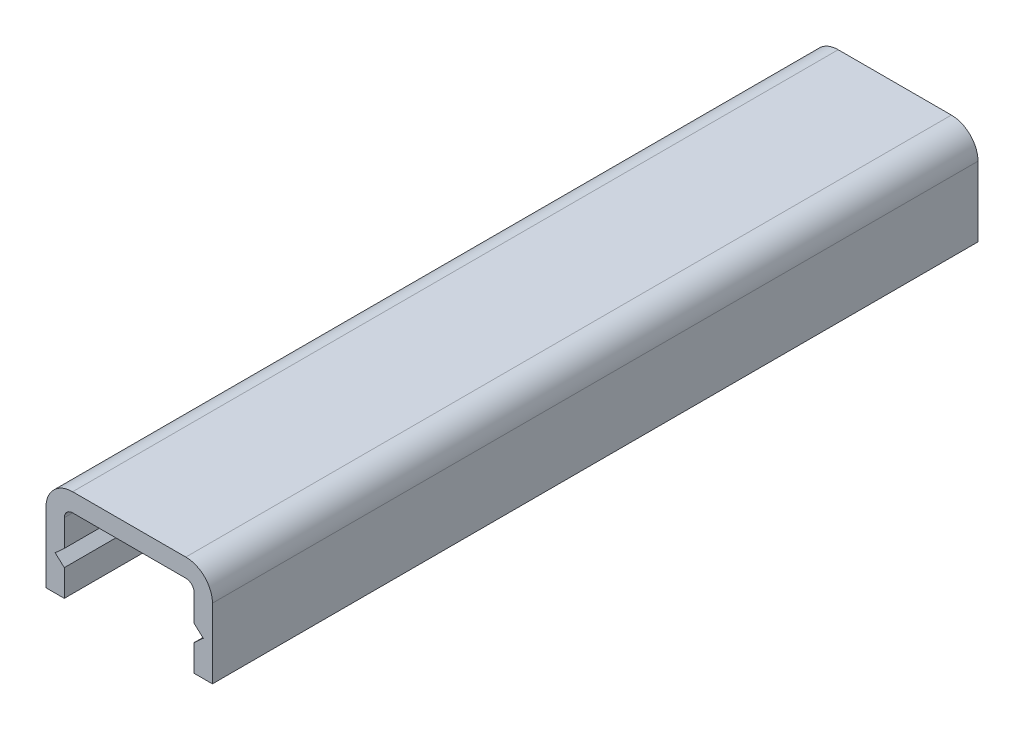
ISO-10303-21;
HEADER;
FILE_DESCRIPTION(('STEP AP214'),'2;1');
FILE_NAME('part.step','',(''),(''),'','','');
FILE_SCHEMA(('AUTOMOTIVE_DESIGN { 1 0 10303 214 1 1 1 1 }'));
ENDSEC;
DATA;
#1=APPLICATION_CONTEXT('core data for automotive mechanical design processes');
#2=APPLICATION_PROTOCOL_DEFINITION('international standard','automotive_design',2000,#1);
#3=PRODUCT_CONTEXT('',#1,'mechanical');
#4=PRODUCT('Part','Part','',(#3));
#5=PRODUCT_RELATED_PRODUCT_CATEGORY('part','',(#4));
#6=PRODUCT_DEFINITION_FORMATION('','',#4);
#7=PRODUCT_DEFINITION_CONTEXT('part definition',#1,'design');
#8=PRODUCT_DEFINITION('design','',#6,#7);
#9=PRODUCT_DEFINITION_SHAPE('','',#8);
#10=(LENGTH_UNIT() NAMED_UNIT(*) SI_UNIT(.MILLI.,.METRE.));
#11=(NAMED_UNIT(*) PLANE_ANGLE_UNIT() SI_UNIT($,.RADIAN.));
#12=(NAMED_UNIT(*) SI_UNIT($,.STERADIAN.) SOLID_ANGLE_UNIT());
#13=UNCERTAINTY_MEASURE_WITH_UNIT(LENGTH_MEASURE(1.E-05),#10,'distance_accuracy_value','');
#14=(GEOMETRIC_REPRESENTATION_CONTEXT(3) GLOBAL_UNCERTAINTY_ASSIGNED_CONTEXT((#13)) GLOBAL_UNIT_ASSIGNED_CONTEXT((#10,
#11,#12)) REPRESENTATION_CONTEXT('',''));
#15=CARTESIAN_POINT('',(0.,0.,0.));
#16=DIRECTION('',(0.,0.,1.));
#17=DIRECTION('',(1.,0.,0.));
#18=AXIS2_PLACEMENT_3D('',#15,#16,#17);
#19=CARTESIAN_POINT('',(0.,0.,46.));
#20=DIRECTION('',(0.,1.,0.));
#21=DIRECTION('',(0.,0.,1.));
#22=AXIS2_PLACEMENT_3D('',#19,#20,#21);
#23=PLANE('',#22);
#24=DIRECTION('',(1.,0.,0.));
#25=VECTOR('',#24,1.);
#26=CARTESIAN_POINT('',(0.,0.,0.));
#27=LINE('',#26,#25);
#28=CARTESIAN_POINT('',(0.,0.,0.));
#29=VERTEX_POINT('',#28);
#30=CARTESIAN_POINT('',(1.1,0.,0.));
#31=VERTEX_POINT('',#30);
#32=EDGE_CURVE('E187',#29,#31,#27,.T.);
#33=ORIENTED_EDGE('',*,*,#32,.T.);
#34=DIRECTION('',(0.,0.,-1.));
#35=VECTOR('',#34,1.);
#36=CARTESIAN_POINT('',(1.1,0.,46.));
#37=LINE('',#36,#35);
#38=CARTESIAN_POINT('',(1.1,0.,46.));
#39=VERTEX_POINT('',#38);
#40=EDGE_CURVE('E11',#39,#31,#37,.T.);
#41=ORIENTED_EDGE('',*,*,#40,.F.);
#42=DIRECTION('',(1.,0.,0.));
#43=VECTOR('',#42,1.);
#44=CARTESIAN_POINT('',(0.,0.,46.));
#45=LINE('',#44,#43);
#46=CARTESIAN_POINT('',(0.,0.,46.));
#47=VERTEX_POINT('',#46);
#48=EDGE_CURVE('E221',#47,#39,#45,.T.);
#49=ORIENTED_EDGE('',*,*,#48,.F.);
#50=DIRECTION('',(0.,0.,-1.));
#51=VECTOR('',#50,1.);
#52=CARTESIAN_POINT('',(0.,0.,46.));
#53=LINE('',#52,#51);
#54=EDGE_CURVE('E183',#47,#29,#53,.T.);
#55=ORIENTED_EDGE('',*,*,#54,.T.);
#56=EDGE_LOOP('',(#33,#41,#49,#55));
#57=FACE_BOUND('',#56,.T.);
#58=ADVANCED_FACE('F31',(#57),#23,.F.);
#59=CARTESIAN_POINT('',(1.1,1.6,46.));
#60=DIRECTION('',(-1.,0.,0.));
#61=DIRECTION('',(0.,0.,1.));
#62=AXIS2_PLACEMENT_3D('',#59,#60,#61);
#63=PLANE('',#62);
#64=DIRECTION('',(0.,1.,0.));
#65=VECTOR('',#64,1.);
#66=CARTESIAN_POINT('',(1.1,1.6,0.));
#67=LINE('',#66,#65);
#68=CARTESIAN_POINT('',(1.1,1.6,0.));
#69=VERTEX_POINT('',#68);
#70=EDGE_CURVE('E190',#31,#69,#67,.T.);
#71=ORIENTED_EDGE('',*,*,#70,.T.);
#72=DIRECTION('',(0.,0.,-1.));
#73=VECTOR('',#72,1.);
#74=CARTESIAN_POINT('',(1.1,1.6,46.));
#75=LINE('',#74,#73);
#76=CARTESIAN_POINT('',(1.1,1.6,46.));
#77=VERTEX_POINT('',#76);
#78=EDGE_CURVE('E39',#77,#69,#75,.T.);
#79=ORIENTED_EDGE('',*,*,#78,.F.);
#80=DIRECTION('',(0.,1.,0.));
#81=VECTOR('',#80,1.);
#82=CARTESIAN_POINT('',(1.1,1.6,46.));
#83=LINE('',#82,#81);
#84=EDGE_CURVE('E120',#39,#77,#83,.T.);
#85=ORIENTED_EDGE('',*,*,#84,.F.);
#86=ORIENTED_EDGE('',*,*,#40,.T.);
#87=EDGE_LOOP('',(#71,#79,#85,#86));
#88=FACE_BOUND('',#87,.T.);
#89=ADVANCED_FACE('F329',(#88),#63,.F.);
#90=CARTESIAN_POINT('',(1.1,1.6,46.));
#91=DIRECTION('',(-0.672672793996314,-0.739940073395942,0.));
#92=DIRECTION('',(0.739940073395943,-0.672672793996314,0.));
#93=AXIS2_PLACEMENT_3D('',#90,#91,#92);
#94=PLANE('',#93);
#95=DIRECTION('',(-0.739940073395943,0.672672793996314,0.));
#96=VECTOR('',#95,1.);
#97=CARTESIAN_POINT('',(1.1,1.6,0.));
#98=LINE('',#97,#96);
#99=CARTESIAN_POINT('',(0.55,2.1,0.));
#100=VERTEX_POINT('',#99);
#101=EDGE_CURVE('E192',#69,#100,#98,.T.);
#102=ORIENTED_EDGE('',*,*,#101,.T.);
#103=DIRECTION('',(0.,0.,-1.));
#104=VECTOR('',#103,1.);
#105=CARTESIAN_POINT('',(0.55,2.1,46.));
#106=LINE('',#105,#104);
#107=CARTESIAN_POINT('',(0.55,2.1,46.));
#108=VERTEX_POINT('',#107);
#109=EDGE_CURVE('E258',#108,#100,#106,.T.);
#110=ORIENTED_EDGE('',*,*,#109,.F.);
#111=DIRECTION('',(-0.739940073395943,0.672672793996314,0.));
#112=VECTOR('',#111,1.);
#113=CARTESIAN_POINT('',(1.1,1.6,46.));
#114=LINE('',#113,#112);
#115=EDGE_CURVE('E266',#77,#108,#114,.T.);
#116=ORIENTED_EDGE('',*,*,#115,.F.);
#117=ORIENTED_EDGE('',*,*,#78,.T.);
#118=EDGE_LOOP('',(#102,#110,#116,#117));
#119=FACE_BOUND('',#118,.T.);
#120=ADVANCED_FACE('F264',(#119),#94,.F.);
#121=CARTESIAN_POINT('',(1.1,2.6,46.));
#122=DIRECTION('',(-0.672672793996311,0.739940073395945,0.));
#123=DIRECTION('',(-0.739940073395945,-0.672672793996311,0.));
#124=AXIS2_PLACEMENT_3D('',#121,#122,#123);
#125=PLANE('',#124);
#126=DIRECTION('',(0.739940073395945,0.672672793996311,0.));
#127=VECTOR('',#126,1.);
#128=CARTESIAN_POINT('',(1.1,2.6,0.));
#129=LINE('',#128,#127);
#130=CARTESIAN_POINT('',(1.1,2.6,0.));
#131=VERTEX_POINT('',#130);
#132=EDGE_CURVE('E194',#100,#131,#129,.T.);
#133=ORIENTED_EDGE('',*,*,#132,.T.);
#134=DIRECTION('',(0.,0.,-1.));
#135=VECTOR('',#134,1.);
#136=CARTESIAN_POINT('',(1.1,2.6,46.));
#137=LINE('',#136,#135);
#138=CARTESIAN_POINT('',(1.1,2.6,46.));
#139=VERTEX_POINT('',#138);
#140=EDGE_CURVE('E255',#139,#131,#137,.T.);
#141=ORIENTED_EDGE('',*,*,#140,.F.);
#142=DIRECTION('',(0.739940073395945,0.672672793996311,0.));
#143=VECTOR('',#142,1.);
#144=CARTESIAN_POINT('',(1.1,2.6,46.));
#145=LINE('',#144,#143);
#146=EDGE_CURVE('E284',#108,#139,#145,.T.);
#147=ORIENTED_EDGE('',*,*,#146,.F.);
#148=ORIENTED_EDGE('',*,*,#109,.T.);
#149=EDGE_LOOP('',(#133,#141,#147,#148));
#150=FACE_BOUND('',#149,.T.);
#151=ADVANCED_FACE('F275',(#150),#125,.F.);
#152=CARTESIAN_POINT('',(1.1,4.2,46.));
#153=DIRECTION('',(-1.,0.,0.));
#154=DIRECTION('',(0.,-1.,0.));
#155=AXIS2_PLACEMENT_3D('',#152,#153,#154);
#156=PLANE('',#155);
#157=DIRECTION('',(0.,1.,0.));
#158=VECTOR('',#157,1.);
#159=CARTESIAN_POINT('',(1.1,4.2,0.));
#160=LINE('',#159,#158);
#161=CARTESIAN_POINT('',(1.1,4.2,0.));
#162=VERTEX_POINT('',#161);
#163=EDGE_CURVE('E196',#131,#162,#160,.T.);
#164=ORIENTED_EDGE('',*,*,#163,.T.);
#165=DIRECTION('',(0.,0.,-1.));
#166=VECTOR('',#165,1.);
#167=CARTESIAN_POINT('',(1.1,4.2,46.));
#168=LINE('',#167,#166);
#169=CARTESIAN_POINT('',(1.1,4.2,46.));
#170=VERTEX_POINT('',#169);
#171=EDGE_CURVE('E252',#170,#162,#168,.T.);
#172=ORIENTED_EDGE('',*,*,#171,.F.);
#173=DIRECTION('',(0.,1.,0.));
#174=VECTOR('',#173,1.);
#175=CARTESIAN_POINT('',(1.1,4.2,46.));
#176=LINE('',#175,#174);
#177=EDGE_CURVE('E281',#139,#170,#176,.T.);
#178=ORIENTED_EDGE('',*,*,#177,.F.);
#179=ORIENTED_EDGE('',*,*,#140,.T.);
#180=EDGE_LOOP('',(#164,#172,#178,#179));
#181=FACE_BOUND('',#180,.T.);
#182=ADVANCED_FACE('F279',(#181),#156,.F.);
#183=CARTESIAN_POINT('',(1.59999999999999,4.2,46.));
#184=DIRECTION('',(0.,0.,-1.));
#185=DIRECTION('',(-1.,0.,0.));
#186=AXIS2_PLACEMENT_3D('',#183,#184,#185);
#187=CYLINDRICAL_SURFACE('',#186,0.499999999999992);
#188=CARTESIAN_POINT('',(1.59999999999999,4.2,0.));
#189=DIRECTION('',(0.,0.,-1.));
#190=DIRECTION('',(1.,0.,0.));
#191=AXIS2_PLACEMENT_3D('',#188,#189,#190);
#192=CIRCLE('',#191,0.499999999999992);
#193=CARTESIAN_POINT('',(1.59999999999999,4.69999999999999,0.));
#194=VERTEX_POINT('',#193);
#195=EDGE_CURVE('E198',#162,#194,#192,.T.);
#196=ORIENTED_EDGE('',*,*,#195,.T.);
#197=DIRECTION('',(0.,0.,-1.));
#198=VECTOR('',#197,1.);
#199=CARTESIAN_POINT('',(1.59999999999999,4.69999999999999,46.));
#200=LINE('',#199,#198);
#201=CARTESIAN_POINT('',(1.59999999999999,4.69999999999999,46.));
#202=VERTEX_POINT('',#201);
#203=EDGE_CURVE('E249',#202,#194,#200,.T.);
#204=ORIENTED_EDGE('',*,*,#203,.F.);
#205=CARTESIAN_POINT('',(1.59999999999999,4.2,46.));
#206=DIRECTION('',(0.,0.,-1.));
#207=DIRECTION('',(1.,0.,0.));
#208=AXIS2_PLACEMENT_3D('',#205,#206,#207);
#209=CIRCLE('',#208,0.499999999999992);
#210=EDGE_CURVE('E283',#170,#202,#209,.T.);
#211=ORIENTED_EDGE('',*,*,#210,.F.);
#212=ORIENTED_EDGE('',*,*,#171,.T.);
#213=EDGE_LOOP('',(#196,#204,#211,#212));
#214=FACE_BOUND('',#213,.T.);
#215=ADVANCED_FACE('F342',(#214),#187,.F.);
#216=CARTESIAN_POINT('',(1.59999999999999,4.69999999999999,46.));
#217=DIRECTION('',(0.,1.,0.));
#218=DIRECTION('',(0.,0.,1.));
#219=AXIS2_PLACEMENT_3D('',#216,#217,#218);
#220=PLANE('',#219);
#221=DIRECTION('',(1.,0.,0.));
#222=VECTOR('',#221,1.);
#223=CARTESIAN_POINT('',(1.59999999999999,4.69999999999999,0.));
#224=LINE('',#223,#222);
#225=CARTESIAN_POINT('',(8.39999999999998,4.69999999999999,0.));
#226=VERTEX_POINT('',#225);
#227=EDGE_CURVE('E200',#194,#226,#224,.T.);
#228=ORIENTED_EDGE('',*,*,#227,.T.);
#229=DIRECTION('',(0.,0.,-1.));
#230=VECTOR('',#229,1.);
#231=CARTESIAN_POINT('',(8.39999999999998,4.69999999999999,46.));
#232=LINE('',#231,#230);
#233=CARTESIAN_POINT('',(8.39999999999998,4.69999999999999,46.));
#234=VERTEX_POINT('',#233);
#235=EDGE_CURVE('E246',#234,#226,#232,.T.);
#236=ORIENTED_EDGE('',*,*,#235,.F.);
#237=DIRECTION('',(1.,0.,0.));
#238=VECTOR('',#237,1.);
#239=CARTESIAN_POINT('',(1.59999999999999,4.69999999999999,46.));
#240=LINE('',#239,#238);
#241=EDGE_CURVE('E286',#202,#234,#240,.T.);
#242=ORIENTED_EDGE('',*,*,#241,.F.);
#243=ORIENTED_EDGE('',*,*,#203,.T.);
#244=EDGE_LOOP('',(#228,#236,#242,#243));
#245=FACE_BOUND('',#244,.T.);
#246=ADVANCED_FACE('F345',(#245),#220,.F.);
#247=CARTESIAN_POINT('',(8.39999999999998,4.2,46.));
#248=DIRECTION('',(0.,0.,-1.));
#249=DIRECTION('',(-1.,0.,0.));
#250=AXIS2_PLACEMENT_3D('',#247,#248,#249);
#251=CYLINDRICAL_SURFACE('',#250,0.499999999999991);
#252=CARTESIAN_POINT('',(8.39999999999998,4.2,0.));
#253=DIRECTION('',(0.,0.,-1.));
#254=DIRECTION('',(1.,0.,0.));
#255=AXIS2_PLACEMENT_3D('',#252,#253,#254);
#256=CIRCLE('',#255,0.499999999999991);
#257=CARTESIAN_POINT('',(8.89999999999997,4.2,0.));
#258=VERTEX_POINT('',#257);
#259=EDGE_CURVE('E202',#226,#258,#256,.T.);
#260=ORIENTED_EDGE('',*,*,#259,.T.);
#261=DIRECTION('',(0.,0.,-1.));
#262=VECTOR('',#261,1.);
#263=CARTESIAN_POINT('',(8.89999999999997,4.2,46.));
#264=LINE('',#263,#262);
#265=CARTESIAN_POINT('',(8.89999999999997,4.2,46.));
#266=VERTEX_POINT('',#265);
#267=EDGE_CURVE('E243',#266,#258,#264,.T.);
#268=ORIENTED_EDGE('',*,*,#267,.F.);
#269=CARTESIAN_POINT('',(8.39999999999998,4.2,46.));
#270=DIRECTION('',(0.,0.,-1.));
#271=DIRECTION('',(1.,0.,0.));
#272=AXIS2_PLACEMENT_3D('',#269,#270,#271);
#273=CIRCLE('',#272,0.499999999999991);
#274=EDGE_CURVE('E292',#234,#266,#273,.T.);
#275=ORIENTED_EDGE('',*,*,#274,.F.);
#276=ORIENTED_EDGE('',*,*,#235,.T.);
#277=EDGE_LOOP('',(#260,#268,#275,#276));
#278=FACE_BOUND('',#277,.T.);
#279=ADVANCED_FACE('F349',(#278),#251,.F.);
#280=CARTESIAN_POINT('',(8.89999999999997,4.2,46.));
#281=DIRECTION('',(1.,0.,0.));
#282=DIRECTION('',(0.,1.,0.));
#283=AXIS2_PLACEMENT_3D('',#280,#281,#282);
#284=PLANE('',#283);
#285=DIRECTION('',(0.,-1.,0.));
#286=VECTOR('',#285,1.);
#287=CARTESIAN_POINT('',(8.89999999999997,4.2,0.));
#288=LINE('',#287,#286);
#289=CARTESIAN_POINT('',(8.89999999999998,2.6,0.));
#290=VERTEX_POINT('',#289);
#291=EDGE_CURVE('E204',#258,#290,#288,.T.);
#292=ORIENTED_EDGE('',*,*,#291,.T.);
#293=DIRECTION('',(0.,0.,-1.));
#294=VECTOR('',#293,1.);
#295=CARTESIAN_POINT('',(8.89999999999998,2.6,46.));
#296=LINE('',#295,#294);
#297=CARTESIAN_POINT('',(8.89999999999998,2.6,46.));
#298=VERTEX_POINT('',#297);
#299=EDGE_CURVE('E240',#298,#290,#296,.T.);
#300=ORIENTED_EDGE('',*,*,#299,.F.);
#301=DIRECTION('',(0.,-1.,0.));
#302=VECTOR('',#301,1.);
#303=CARTESIAN_POINT('',(8.89999999999997,4.2,46.));
#304=LINE('',#303,#302);
#305=EDGE_CURVE('E294',#266,#298,#304,.T.);
#306=ORIENTED_EDGE('',*,*,#305,.F.);
#307=ORIENTED_EDGE('',*,*,#267,.T.);
#308=EDGE_LOOP('',(#292,#300,#306,#307));
#309=FACE_BOUND('',#308,.T.);
#310=ADVANCED_FACE('F353',(#309),#284,.F.);
#311=CARTESIAN_POINT('',(8.89999999999998,2.6,46.));
#312=DIRECTION('',(0.672672793996294,0.739940073395961,0.));
#313=DIRECTION('',(-0.739940073395961,0.672672793996294,0.));
#314=AXIS2_PLACEMENT_3D('',#311,#312,#313);
#315=PLANE('',#314);
#316=DIRECTION('',(0.739940073395961,-0.672672793996294,0.));
#317=VECTOR('',#316,1.);
#318=CARTESIAN_POINT('',(8.89999999999998,2.6,0.));
#319=LINE('',#318,#317);
#320=CARTESIAN_POINT('',(9.45,2.1,0.));
#321=VERTEX_POINT('',#320);
#322=EDGE_CURVE('E206',#290,#321,#319,.T.);
#323=ORIENTED_EDGE('',*,*,#322,.T.);
#324=DIRECTION('',(0.,0.,-1.));
#325=VECTOR('',#324,1.);
#326=CARTESIAN_POINT('',(9.45,2.1,46.));
#327=LINE('',#326,#325);
#328=CARTESIAN_POINT('',(9.45,2.1,46.));
#329=VERTEX_POINT('',#328);
#330=EDGE_CURVE('E237',#329,#321,#327,.T.);
#331=ORIENTED_EDGE('',*,*,#330,.F.);
#332=DIRECTION('',(0.739940073395961,-0.672672793996294,0.));
#333=VECTOR('',#332,1.);
#334=CARTESIAN_POINT('',(8.89999999999998,2.6,46.));
#335=LINE('',#334,#333);
#336=EDGE_CURVE('E296',#298,#329,#335,.T.);
#337=ORIENTED_EDGE('',*,*,#336,.F.);
#338=ORIENTED_EDGE('',*,*,#299,.T.);
#339=EDGE_LOOP('',(#323,#331,#337,#338));
#340=FACE_BOUND('',#339,.T.);
#341=ADVANCED_FACE('F357',(#340),#315,.F.);
#342=CARTESIAN_POINT('',(8.89999999999998,1.6,46.));
#343=DIRECTION('',(0.672672793996296,-0.739940073395959,0.));
#344=DIRECTION('',(0.739940073395959,0.672672793996296,0.));
#345=AXIS2_PLACEMENT_3D('',#342,#343,#344);
#346=PLANE('',#345);
#347=DIRECTION('',(-0.739940073395959,-0.672672793996296,0.));
#348=VECTOR('',#347,1.);
#349=CARTESIAN_POINT('',(8.89999999999998,1.6,0.));
#350=LINE('',#349,#348);
#351=CARTESIAN_POINT('',(8.89999999999998,1.6,0.));
#352=VERTEX_POINT('',#351);
#353=EDGE_CURVE('E208',#321,#352,#350,.T.);
#354=ORIENTED_EDGE('',*,*,#353,.T.);
#355=DIRECTION('',(0.,0.,-1.));
#356=VECTOR('',#355,1.);
#357=CARTESIAN_POINT('',(8.89999999999998,1.6,46.));
#358=LINE('',#357,#356);
#359=CARTESIAN_POINT('',(8.89999999999998,1.6,46.));
#360=VERTEX_POINT('',#359);
#361=EDGE_CURVE('E234',#360,#352,#358,.T.);
#362=ORIENTED_EDGE('',*,*,#361,.F.);
#363=DIRECTION('',(-0.739940073395959,-0.672672793996296,0.));
#364=VECTOR('',#363,1.);
#365=CARTESIAN_POINT('',(8.89999999999998,1.6,46.));
#366=LINE('',#365,#364);
#367=EDGE_CURVE('E298',#329,#360,#366,.T.);
#368=ORIENTED_EDGE('',*,*,#367,.F.);
#369=ORIENTED_EDGE('',*,*,#330,.T.);
#370=EDGE_LOOP('',(#354,#362,#368,#369));
#371=FACE_BOUND('',#370,.T.);
#372=ADVANCED_FACE('F361',(#371),#346,.F.);
#373=CARTESIAN_POINT('',(8.89999999999998,1.6,46.));
#374=DIRECTION('',(1.,0.,0.));
#375=DIRECTION('',(0.,0.,-1.));
#376=AXIS2_PLACEMENT_3D('',#373,#374,#375);
#377=PLANE('',#376);
#378=DIRECTION('',(0.,-1.,0.));
#379=VECTOR('',#378,1.);
#380=CARTESIAN_POINT('',(8.89999999999998,1.6,0.));
#381=LINE('',#380,#379);
#382=CARTESIAN_POINT('',(8.89999999999998,0.,0.));
#383=VERTEX_POINT('',#382);
#384=EDGE_CURVE('E210',#352,#383,#381,.T.);
#385=ORIENTED_EDGE('',*,*,#384,.T.);
#386=DIRECTION('',(0.,0.,-1.));
#387=VECTOR('',#386,1.);
#388=CARTESIAN_POINT('',(8.89999999999998,0.,46.));
#389=LINE('',#388,#387);
#390=CARTESIAN_POINT('',(8.89999999999998,0.,46.));
#391=VERTEX_POINT('',#390);
#392=EDGE_CURVE('E231',#391,#383,#389,.T.);
#393=ORIENTED_EDGE('',*,*,#392,.F.);
#394=DIRECTION('',(0.,-1.,0.));
#395=VECTOR('',#394,1.);
#396=CARTESIAN_POINT('',(8.89999999999998,1.6,46.));
#397=LINE('',#396,#395);
#398=EDGE_CURVE('E300',#360,#391,#397,.T.);
#399=ORIENTED_EDGE('',*,*,#398,.F.);
#400=ORIENTED_EDGE('',*,*,#361,.T.);
#401=EDGE_LOOP('',(#385,#393,#399,#400));
#402=FACE_BOUND('',#401,.T.);
#403=ADVANCED_FACE('F365',(#402),#377,.F.);
#404=CARTESIAN_POINT('',(9.99999999999998,0.,46.));
#405=DIRECTION('',(0.,1.,0.));
#406=DIRECTION('',(0.,0.,1.));
#407=AXIS2_PLACEMENT_3D('',#404,#405,#406);
#408=PLANE('',#407);
#409=DIRECTION('',(1.,0.,0.));
#410=VECTOR('',#409,1.);
#411=CARTESIAN_POINT('',(9.99999999999998,0.,0.));
#412=LINE('',#411,#410);
#413=CARTESIAN_POINT('',(9.99999999999998,0.,0.));
#414=VERTEX_POINT('',#413);
#415=EDGE_CURVE('E212',#383,#414,#412,.T.);
#416=ORIENTED_EDGE('',*,*,#415,.T.);
#417=DIRECTION('',(0.,0.,-1.));
#418=VECTOR('',#417,1.);
#419=CARTESIAN_POINT('',(9.99999999999998,0.,46.));
#420=LINE('',#419,#418);
#421=CARTESIAN_POINT('',(9.99999999999998,0.,46.));
#422=VERTEX_POINT('',#421);
#423=EDGE_CURVE('E228',#422,#414,#420,.T.);
#424=ORIENTED_EDGE('',*,*,#423,.F.);
#425=DIRECTION('',(1.,0.,0.));
#426=VECTOR('',#425,1.);
#427=CARTESIAN_POINT('',(9.99999999999998,0.,46.));
#428=LINE('',#427,#426);
#429=EDGE_CURVE('E302',#391,#422,#428,.T.);
#430=ORIENTED_EDGE('',*,*,#429,.F.);
#431=ORIENTED_EDGE('',*,*,#392,.T.);
#432=EDGE_LOOP('',(#416,#424,#430,#431));
#433=FACE_BOUND('',#432,.T.);
#434=ADVANCED_FACE('F369',(#433),#408,.F.);
#435=CARTESIAN_POINT('',(9.99999999999998,4.19999999999999,46.));
#436=DIRECTION('',(-1.,0.,0.));
#437=DIRECTION('',(0.,0.,1.));
#438=AXIS2_PLACEMENT_3D('',#435,#436,#437);
#439=PLANE('',#438);
#440=DIRECTION('',(0.,1.,0.));
#441=VECTOR('',#440,1.);
#442=CARTESIAN_POINT('',(9.99999999999998,4.19999999999999,0.));
#443=LINE('',#442,#441);
#444=CARTESIAN_POINT('',(9.99999999999998,4.19999999999999,0.));
#445=VERTEX_POINT('',#444);
#446=EDGE_CURVE('E214',#414,#445,#443,.T.);
#447=ORIENTED_EDGE('',*,*,#446,.T.);
#448=DIRECTION('',(0.,0.,-1.));
#449=VECTOR('',#448,1.);
#450=CARTESIAN_POINT('',(9.99999999999998,4.19999999999999,46.));
#451=LINE('',#450,#449);
#452=CARTESIAN_POINT('',(9.99999999999998,4.19999999999999,46.));
#453=VERTEX_POINT('',#452);
#454=EDGE_CURVE('E225',#453,#445,#451,.T.);
#455=ORIENTED_EDGE('',*,*,#454,.F.);
#456=DIRECTION('',(0.,1.,0.));
#457=VECTOR('',#456,1.);
#458=CARTESIAN_POINT('',(9.99999999999998,4.19999999999999,46.));
#459=LINE('',#458,#457);
#460=EDGE_CURVE('E304',#422,#453,#459,.T.);
#461=ORIENTED_EDGE('',*,*,#460,.F.);
#462=ORIENTED_EDGE('',*,*,#423,.T.);
#463=EDGE_LOOP('',(#447,#455,#461,#462));
#464=FACE_BOUND('',#463,.T.);
#465=ADVANCED_FACE('F310',(#464),#439,.F.);
#466=CARTESIAN_POINT('',(8.39999999999998,4.19999999999999,46.));
#467=DIRECTION('',(0.,0.,-1.));
#468=DIRECTION('',(-1.,0.,0.));
#469=AXIS2_PLACEMENT_3D('',#466,#467,#468);
#470=CYLINDRICAL_SURFACE('',#469,1.6);
#471=CARTESIAN_POINT('',(8.39999999999998,4.19999999999999,0.));
#472=DIRECTION('',(0.,0.,1.));
#473=DIRECTION('',(-1.,0.,0.));
#474=AXIS2_PLACEMENT_3D('',#471,#472,#473);
#475=CIRCLE('',#474,1.6);
#476=CARTESIAN_POINT('',(8.39999999999998,5.79999999999999,0.));
#477=VERTEX_POINT('',#476);
#478=EDGE_CURVE('E216',#445,#477,#475,.T.);
#479=ORIENTED_EDGE('',*,*,#478,.T.);
#480=DIRECTION('',(0.,0.,-1.));
#481=VECTOR('',#480,1.);
#482=CARTESIAN_POINT('',(8.39999999999998,5.79999999999999,46.));
#483=LINE('',#482,#481);
#484=CARTESIAN_POINT('',(8.39999999999998,5.79999999999999,46.));
#485=VERTEX_POINT('',#484);
#486=EDGE_CURVE('E178',#485,#477,#483,.T.);
#487=ORIENTED_EDGE('',*,*,#486,.F.);
#488=CARTESIAN_POINT('',(8.39999999999998,4.19999999999999,46.));
#489=DIRECTION('',(0.,0.,1.));
#490=DIRECTION('',(-1.,0.,0.));
#491=AXIS2_PLACEMENT_3D('',#488,#489,#490);
#492=CIRCLE('',#491,1.6);
#493=EDGE_CURVE('E169',#453,#485,#492,.T.);
#494=ORIENTED_EDGE('',*,*,#493,.F.);
#495=ORIENTED_EDGE('',*,*,#454,.T.);
#496=EDGE_LOOP('',(#479,#487,#494,#495));
#497=FACE_BOUND('',#496,.T.);
#498=ADVANCED_FACE('F314',(#497),#470,.T.);
#499=CARTESIAN_POINT('',(1.6,5.79999999999999,46.));
#500=DIRECTION('',(0.,-1.,0.));
#501=DIRECTION('',(0.,0.,-1.));
#502=AXIS2_PLACEMENT_3D('',#499,#500,#501);
#503=PLANE('',#502);
#504=DIRECTION('',(-1.,0.,0.));
#505=VECTOR('',#504,1.);
#506=CARTESIAN_POINT('',(1.6,5.79999999999999,0.));
#507=LINE('',#506,#505);
#508=CARTESIAN_POINT('',(1.6,5.79999999999999,0.));
#509=VERTEX_POINT('',#508);
#510=EDGE_CURVE('E177',#477,#509,#507,.T.);
#511=ORIENTED_EDGE('',*,*,#510,.T.);
#512=DIRECTION('',(0.,0.,-1.));
#513=VECTOR('',#512,1.);
#514=CARTESIAN_POINT('',(1.6,5.79999999999999,46.));
#515=LINE('',#514,#513);
#516=CARTESIAN_POINT('',(1.6,5.79999999999999,46.));
#517=VERTEX_POINT('',#516);
#518=EDGE_CURVE('E174',#517,#509,#515,.T.);
#519=ORIENTED_EDGE('',*,*,#518,.F.);
#520=DIRECTION('',(-1.,0.,0.));
#521=VECTOR('',#520,1.);
#522=CARTESIAN_POINT('',(1.6,5.79999999999999,46.));
#523=LINE('',#522,#521);
#524=EDGE_CURVE('E163',#485,#517,#523,.T.);
#525=ORIENTED_EDGE('',*,*,#524,.F.);
#526=ORIENTED_EDGE('',*,*,#486,.T.);
#527=EDGE_LOOP('',(#511,#519,#525,#526));
#528=FACE_BOUND('',#527,.T.);
#529=ADVANCED_FACE('F175',(#528),#503,.F.);
#530=CARTESIAN_POINT('',(1.6,4.19999999999999,46.));
#531=DIRECTION('',(0.,0.,-1.));
#532=DIRECTION('',(-1.,0.,0.));
#533=AXIS2_PLACEMENT_3D('',#530,#531,#532);
#534=CYLINDRICAL_SURFACE('',#533,1.6);
#535=CARTESIAN_POINT('',(1.6,4.19999999999999,0.));
#536=DIRECTION('',(0.,0.,1.));
#537=DIRECTION('',(-1.,0.,0.));
#538=AXIS2_PLACEMENT_3D('',#535,#536,#537);
#539=CIRCLE('',#538,1.6);
#540=CARTESIAN_POINT('',(0.,4.19999999999999,0.));
#541=VERTEX_POINT('',#540);
#542=EDGE_CURVE('E106',#509,#541,#539,.T.);
#543=ORIENTED_EDGE('',*,*,#542,.T.);
#544=DIRECTION('',(0.,0.,-1.));
#545=VECTOR('',#544,1.);
#546=CARTESIAN_POINT('',(0.,4.19999999999999,46.));
#547=LINE('',#546,#545);
#548=CARTESIAN_POINT('',(0.,4.19999999999999,46.));
#549=VERTEX_POINT('',#548);
#550=EDGE_CURVE('E179',#549,#541,#547,.T.);
#551=ORIENTED_EDGE('',*,*,#550,.F.);
#552=CARTESIAN_POINT('',(1.6,4.19999999999999,46.));
#553=DIRECTION('',(0.,0.,1.));
#554=DIRECTION('',(-1.,0.,0.));
#555=AXIS2_PLACEMENT_3D('',#552,#553,#554);
#556=CIRCLE('',#555,1.6);
#557=EDGE_CURVE('E167',#517,#549,#556,.T.);
#558=ORIENTED_EDGE('',*,*,#557,.F.);
#559=ORIENTED_EDGE('',*,*,#518,.T.);
#560=EDGE_LOOP('',(#543,#551,#558,#559));
#561=FACE_BOUND('',#560,.T.);
#562=ADVANCED_FACE('F181',(#561),#534,.T.);
#563=CARTESIAN_POINT('',(0.,4.19999999999999,46.));
#564=DIRECTION('',(1.,0.,0.));
#565=DIRECTION('',(0.,1.,0.));
#566=AXIS2_PLACEMENT_3D('',#563,#564,#565);
#567=PLANE('',#566);
#568=DIRECTION('',(0.,-1.,0.));
#569=VECTOR('',#568,1.);
#570=CARTESIAN_POINT('',(0.,4.19999999999999,0.));
#571=LINE('',#570,#569);
#572=EDGE_CURVE('E112',#541,#29,#571,.T.);
#573=ORIENTED_EDGE('',*,*,#572,.T.);
#574=ORIENTED_EDGE('',*,*,#54,.F.);
#575=DIRECTION('',(0.,-1.,0.));
#576=VECTOR('',#575,1.);
#577=CARTESIAN_POINT('',(0.,4.19999999999999,46.));
#578=LINE('',#577,#576);
#579=EDGE_CURVE('E47',#549,#47,#578,.T.);
#580=ORIENTED_EDGE('',*,*,#579,.F.);
#581=ORIENTED_EDGE('',*,*,#550,.T.);
#582=EDGE_LOOP('',(#573,#574,#580,#581));
#583=FACE_BOUND('',#582,.T.);
#584=ADVANCED_FACE('F318',(#583),#567,.F.);
#585=CARTESIAN_POINT('',(1.59999999999999,4.2,46.));
#586=DIRECTION('',(0.,0.,1.));
#587=DIRECTION('',(1.,0.,0.));
#588=AXIS2_PLACEMENT_3D('',#585,#586,#587);
#589=PLANE('',#588);
#590=ORIENTED_EDGE('',*,*,#48,.T.);
#591=ORIENTED_EDGE('',*,*,#84,.T.);
#592=ORIENTED_EDGE('',*,*,#115,.T.);
#593=ORIENTED_EDGE('',*,*,#146,.T.);
#594=ORIENTED_EDGE('',*,*,#177,.T.);
#595=ORIENTED_EDGE('',*,*,#210,.T.);
#596=ORIENTED_EDGE('',*,*,#241,.T.);
#597=ORIENTED_EDGE('',*,*,#274,.T.);
#598=ORIENTED_EDGE('',*,*,#305,.T.);
#599=ORIENTED_EDGE('',*,*,#336,.T.);
#600=ORIENTED_EDGE('',*,*,#367,.T.);
#601=ORIENTED_EDGE('',*,*,#398,.T.);
#602=ORIENTED_EDGE('',*,*,#429,.T.);
#603=ORIENTED_EDGE('',*,*,#460,.T.);
#604=ORIENTED_EDGE('',*,*,#493,.T.);
#605=ORIENTED_EDGE('',*,*,#524,.T.);
#606=ORIENTED_EDGE('',*,*,#557,.T.);
#607=ORIENTED_EDGE('',*,*,#579,.T.);
#608=EDGE_LOOP('',(#590,#591,#592,#593,#594,#595,#596,#597,#598,#599,#600,#601,#602,#603,#604,
#605,#606,#607));
#609=FACE_BOUND('',#608,.T.);
#610=ADVANCED_FACE('F165',(#609),#589,.T.);
#611=CARTESIAN_POINT('',(1.59999999999999,4.2,0.));
#612=DIRECTION('',(0.,0.,1.));
#613=DIRECTION('',(1.,0.,0.));
#614=AXIS2_PLACEMENT_3D('',#611,#612,#613);
#615=PLANE('',#614);
#616=ORIENTED_EDGE('',*,*,#32,.F.);
#617=ORIENTED_EDGE('',*,*,#572,.F.);
#618=ORIENTED_EDGE('',*,*,#542,.F.);
#619=ORIENTED_EDGE('',*,*,#510,.F.);
#620=ORIENTED_EDGE('',*,*,#478,.F.);
#621=ORIENTED_EDGE('',*,*,#446,.F.);
#622=ORIENTED_EDGE('',*,*,#415,.F.);
#623=ORIENTED_EDGE('',*,*,#384,.F.);
#624=ORIENTED_EDGE('',*,*,#353,.F.);
#625=ORIENTED_EDGE('',*,*,#322,.F.);
#626=ORIENTED_EDGE('',*,*,#291,.F.);
#627=ORIENTED_EDGE('',*,*,#259,.F.);
#628=ORIENTED_EDGE('',*,*,#227,.F.);
#629=ORIENTED_EDGE('',*,*,#195,.F.);
#630=ORIENTED_EDGE('',*,*,#163,.F.);
#631=ORIENTED_EDGE('',*,*,#132,.F.);
#632=ORIENTED_EDGE('',*,*,#101,.F.);
#633=ORIENTED_EDGE('',*,*,#70,.F.);
#634=EDGE_LOOP('',(#616,#617,#618,#619,#620,#621,#622,#623,#624,#625,#626,#627,#628,#629,#630,
#631,#632,#633));
#635=FACE_BOUND('',#634,.T.);
#636=ADVANCED_FACE('F270',(#635),#615,.F.);
#637=CLOSED_SHELL('',(#58,#89,#120,#151,#182,#215,#246,#279,#310,#341,#372,#403,#434,#465,#498,
#529,#562,#584,#610,#636));
#638=MANIFOLD_SOLID_BREP('B2',#637);
#639=ADVANCED_BREP_SHAPE_REPRESENTATION('',(#18,#638),#14);
#640=SHAPE_DEFINITION_REPRESENTATION(#9,#639);
ENDSEC;
END-ISO-10303-21;
